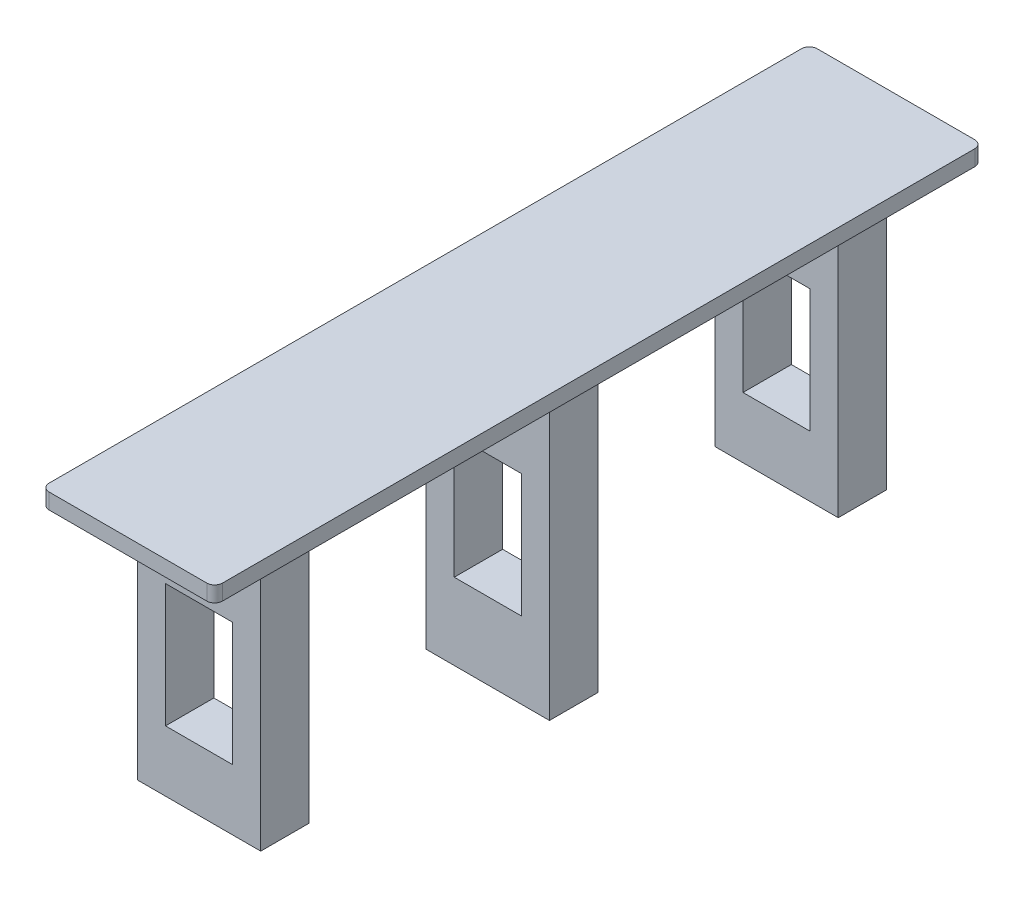
ISO-10303-21;
HEADER;
FILE_DESCRIPTION(('STEP AP214'),'2;1');
FILE_NAME('part.step','',(''),(''),'','','');
FILE_SCHEMA(('AUTOMOTIVE_DESIGN { 1 0 10303 214 1 1 1 1 }'));
ENDSEC;
DATA;
#1=APPLICATION_CONTEXT('core data for automotive mechanical design processes');
#2=APPLICATION_PROTOCOL_DEFINITION('international standard','automotive_design',2000,#1);
#3=PRODUCT_CONTEXT('',#1,'mechanical');
#4=PRODUCT('Part','Part','',(#3));
#5=PRODUCT_RELATED_PRODUCT_CATEGORY('part','',(#4));
#6=PRODUCT_DEFINITION_FORMATION('','',#4);
#7=PRODUCT_DEFINITION_CONTEXT('part definition',#1,'design');
#8=PRODUCT_DEFINITION('design','',#6,#7);
#9=PRODUCT_DEFINITION_SHAPE('','',#8);
#10=(LENGTH_UNIT() NAMED_UNIT(*) SI_UNIT(.MILLI.,.METRE.));
#11=(NAMED_UNIT(*) PLANE_ANGLE_UNIT() SI_UNIT($,.RADIAN.));
#12=(NAMED_UNIT(*) SI_UNIT($,.STERADIAN.) SOLID_ANGLE_UNIT());
#13=UNCERTAINTY_MEASURE_WITH_UNIT(LENGTH_MEASURE(1.E-05),#10,'distance_accuracy_value','');
#14=(GEOMETRIC_REPRESENTATION_CONTEXT(3) GLOBAL_UNCERTAINTY_ASSIGNED_CONTEXT((#13)) GLOBAL_UNIT_ASSIGNED_CONTEXT((#10,
#11,#12)) REPRESENTATION_CONTEXT('',''));
#15=CARTESIAN_POINT('',(0.,0.,0.));
#16=DIRECTION('',(0.,0.,1.));
#17=DIRECTION('',(1.,0.,0.));
#18=AXIS2_PLACEMENT_3D('',#15,#16,#17);
#19=CARTESIAN_POINT('',(-1.4097,0.254,-6.1214));
#20=DIRECTION('',(1.,0.,0.));
#21=DIRECTION('',(0.,0.,-1.));
#22=AXIS2_PLACEMENT_3D('',#19,#20,#21);
#23=PLANE('',#22);
#24=DIRECTION('',(0.,0.,1.));
#25=VECTOR('',#24,1.);
#26=CARTESIAN_POINT('',(-1.4097,0.,-6.1214));
#27=LINE('',#26,#25);
#28=CARTESIAN_POINT('',(-1.4097,0.,-6.1214));
#29=VERTEX_POINT('',#28);
#30=CARTESIAN_POINT('',(-1.4097,0.,6.1214));
#31=VERTEX_POINT('',#30);
#32=EDGE_CURVE('E10',#29,#31,#27,.T.);
#33=ORIENTED_EDGE('',*,*,#32,.T.);
#34=DIRECTION('',(0.,-1.,0.));
#35=VECTOR('',#34,1.);
#36=CARTESIAN_POINT('',(-1.4097,0.254,6.1214));
#37=LINE('',#36,#35);
#38=CARTESIAN_POINT('',(-1.4097,0.254,6.1214));
#39=VERTEX_POINT('',#38);
#40=EDGE_CURVE('E24',#39,#31,#37,.T.);
#41=ORIENTED_EDGE('',*,*,#40,.F.);
#42=DIRECTION('',(0.,0.,1.));
#43=VECTOR('',#42,1.);
#44=CARTESIAN_POINT('',(-1.4097,0.254,-6.1214));
#45=LINE('',#44,#43);
#46=CARTESIAN_POINT('',(-1.4097,0.254,-6.1214));
#47=VERTEX_POINT('',#46);
#48=EDGE_CURVE('E647',#47,#39,#45,.T.);
#49=ORIENTED_EDGE('',*,*,#48,.F.);
#50=DIRECTION('',(0.,-1.,0.));
#51=VECTOR('',#50,1.);
#52=CARTESIAN_POINT('',(-1.4097,0.254,-6.1214));
#53=LINE('',#52,#51);
#54=EDGE_CURVE('E643',#47,#29,#53,.T.);
#55=ORIENTED_EDGE('',*,*,#54,.T.);
#56=EDGE_LOOP('',(#33,#41,#49,#55));
#57=FACE_BOUND('',#56,.T.);
#58=ADVANCED_FACE('F16',(#57),#23,.F.);
#59=CARTESIAN_POINT('',(-1.28270000000003,0.254,-6.1214));
#60=DIRECTION('',(0.,-1.,0.));
#61=DIRECTION('',(0.707106781186463,0.,0.707106781186632));
#62=AXIS2_PLACEMENT_3D('',#59,#60,#61);
#63=CYLINDRICAL_SURFACE('',#62,0.126999999999972);
#64=CARTESIAN_POINT('',(-1.28270000000003,0.,-6.1214));
#65=DIRECTION('',(0.,1.,0.));
#66=DIRECTION('',(1.,0.,0.));
#67=AXIS2_PLACEMENT_3D('',#64,#65,#66);
#68=CIRCLE('',#67,0.126999999999972);
#69=CARTESIAN_POINT('',(-1.2827,0.,-6.2484));
#70=VERTEX_POINT('',#69);
#71=EDGE_CURVE('E638',#70,#29,#68,.T.);
#72=ORIENTED_EDGE('',*,*,#71,.T.);
#73=ORIENTED_EDGE('',*,*,#54,.F.);
#74=CARTESIAN_POINT('',(-1.28270000000003,0.254,-6.1214));
#75=DIRECTION('',(0.,1.,0.));
#76=DIRECTION('',(1.,0.,0.));
#77=AXIS2_PLACEMENT_3D('',#74,#75,#76);
#78=CIRCLE('',#77,0.126999999999972);
#79=CARTESIAN_POINT('',(-1.2827,0.254,-6.2484));
#80=VERTEX_POINT('',#79);
#81=EDGE_CURVE('E633',#80,#47,#78,.T.);
#82=ORIENTED_EDGE('',*,*,#81,.F.);
#83=DIRECTION('',(0.,-1.,0.));
#84=VECTOR('',#83,1.);
#85=CARTESIAN_POINT('',(-1.2827,0.254,-6.2484));
#86=LINE('',#85,#84);
#87=EDGE_CURVE('E629',#80,#70,#86,.T.);
#88=ORIENTED_EDGE('',*,*,#87,.T.);
#89=EDGE_LOOP('',(#72,#73,#82,#88));
#90=FACE_BOUND('',#89,.T.);
#91=ADVANCED_FACE('F665',(#90),#63,.T.);
#92=CARTESIAN_POINT('',(1.2827,0.254,-6.2484));
#93=DIRECTION('',(0.,0.,1.));
#94=DIRECTION('',(1.,0.,0.));
#95=AXIS2_PLACEMENT_3D('',#92,#93,#94);
#96=PLANE('',#95);
#97=DIRECTION('',(-1.,0.,0.));
#98=VECTOR('',#97,1.);
#99=CARTESIAN_POINT('',(1.2827,0.,-6.2484));
#100=LINE('',#99,#98);
#101=CARTESIAN_POINT('',(1.2827,0.,-6.2484));
#102=VERTEX_POINT('',#101);
#103=EDGE_CURVE('E624',#102,#70,#100,.T.);
#104=ORIENTED_EDGE('',*,*,#103,.T.);
#105=ORIENTED_EDGE('',*,*,#87,.F.);
#106=DIRECTION('',(-1.,0.,0.));
#107=VECTOR('',#106,1.);
#108=CARTESIAN_POINT('',(1.2827,0.254,-6.2484));
#109=LINE('',#108,#107);
#110=CARTESIAN_POINT('',(1.2827,0.254,-6.2484));
#111=VERTEX_POINT('',#110);
#112=EDGE_CURVE('E619',#111,#80,#109,.T.);
#113=ORIENTED_EDGE('',*,*,#112,.F.);
#114=DIRECTION('',(0.,-1.,0.));
#115=VECTOR('',#114,1.);
#116=CARTESIAN_POINT('',(1.2827,0.254,-6.2484));
#117=LINE('',#116,#115);
#118=EDGE_CURVE('E615',#111,#102,#117,.T.);
#119=ORIENTED_EDGE('',*,*,#118,.T.);
#120=EDGE_LOOP('',(#104,#105,#113,#119));
#121=FACE_BOUND('',#120,.T.);
#122=ADVANCED_FACE('F686',(#121),#96,.F.);
#123=CARTESIAN_POINT('',(1.28270000000003,0.254,-6.1214));
#124=DIRECTION('',(0.,-1.,0.));
#125=DIRECTION('',(-0.707106781186464,0.,0.707106781186631));
#126=AXIS2_PLACEMENT_3D('',#123,#124,#125);
#127=CYLINDRICAL_SURFACE('',#126,0.126999999999971);
#128=CARTESIAN_POINT('',(1.28270000000003,0.,-6.1214));
#129=DIRECTION('',(0.,1.,0.));
#130=DIRECTION('',(1.,0.,0.));
#131=AXIS2_PLACEMENT_3D('',#128,#129,#130);
#132=CIRCLE('',#131,0.126999999999971);
#133=CARTESIAN_POINT('',(1.4097,0.,-6.1214));
#134=VERTEX_POINT('',#133);
#135=EDGE_CURVE('E610',#134,#102,#132,.T.);
#136=ORIENTED_EDGE('',*,*,#135,.T.);
#137=ORIENTED_EDGE('',*,*,#118,.F.);
#138=CARTESIAN_POINT('',(1.28270000000003,0.254,-6.1214));
#139=DIRECTION('',(0.,1.,0.));
#140=DIRECTION('',(1.,0.,0.));
#141=AXIS2_PLACEMENT_3D('',#138,#139,#140);
#142=CIRCLE('',#141,0.126999999999971);
#143=CARTESIAN_POINT('',(1.4097,0.254,-6.1214));
#144=VERTEX_POINT('',#143);
#145=EDGE_CURVE('E605',#144,#111,#142,.T.);
#146=ORIENTED_EDGE('',*,*,#145,.F.);
#147=DIRECTION('',(0.,-1.,0.));
#148=VECTOR('',#147,1.);
#149=CARTESIAN_POINT('',(1.4097,0.254,-6.1214));
#150=LINE('',#149,#148);
#151=EDGE_CURVE('E601',#144,#134,#150,.T.);
#152=ORIENTED_EDGE('',*,*,#151,.T.);
#153=EDGE_LOOP('',(#136,#137,#146,#152));
#154=FACE_BOUND('',#153,.T.);
#155=ADVANCED_FACE('F683',(#154),#127,.T.);
#156=CARTESIAN_POINT('',(1.4097,0.254,6.1214));
#157=DIRECTION('',(-1.,0.,0.));
#158=DIRECTION('',(0.,0.,1.));
#159=AXIS2_PLACEMENT_3D('',#156,#157,#158);
#160=PLANE('',#159);
#161=DIRECTION('',(0.,0.,-1.));
#162=VECTOR('',#161,1.);
#163=CARTESIAN_POINT('',(1.4097,0.,6.1214));
#164=LINE('',#163,#162);
#165=CARTESIAN_POINT('',(1.4097,0.,6.1214));
#166=VERTEX_POINT('',#165);
#167=EDGE_CURVE('E596',#166,#134,#164,.T.);
#168=ORIENTED_EDGE('',*,*,#167,.T.);
#169=ORIENTED_EDGE('',*,*,#151,.F.);
#170=DIRECTION('',(0.,0.,-1.));
#171=VECTOR('',#170,1.);
#172=CARTESIAN_POINT('',(1.4097,0.254,6.1214));
#173=LINE('',#172,#171);
#174=CARTESIAN_POINT('',(1.4097,0.254,6.1214));
#175=VERTEX_POINT('',#174);
#176=EDGE_CURVE('E591',#175,#144,#173,.T.);
#177=ORIENTED_EDGE('',*,*,#176,.F.);
#178=DIRECTION('',(0.,-1.,0.));
#179=VECTOR('',#178,1.);
#180=CARTESIAN_POINT('',(1.4097,0.254,6.1214));
#181=LINE('',#180,#179);
#182=EDGE_CURVE('E587',#175,#166,#181,.T.);
#183=ORIENTED_EDGE('',*,*,#182,.T.);
#184=EDGE_LOOP('',(#168,#169,#177,#183));
#185=FACE_BOUND('',#184,.T.);
#186=ADVANCED_FACE('F679',(#185),#160,.F.);
#187=CARTESIAN_POINT('',(1.28270000000003,0.254,6.1214));
#188=DIRECTION('',(0.,-1.,0.));
#189=DIRECTION('',(-0.707106781186464,0.,-0.707106781186632));
#190=AXIS2_PLACEMENT_3D('',#187,#188,#189);
#191=CYLINDRICAL_SURFACE('',#190,0.126999999999972);
#192=CARTESIAN_POINT('',(1.28270000000003,0.,6.1214));
#193=DIRECTION('',(0.,1.,0.));
#194=DIRECTION('',(1.,0.,0.));
#195=AXIS2_PLACEMENT_3D('',#192,#193,#194);
#196=CIRCLE('',#195,0.126999999999972);
#197=CARTESIAN_POINT('',(1.2827,0.,6.2484));
#198=VERTEX_POINT('',#197);
#199=EDGE_CURVE('E582',#198,#166,#196,.T.);
#200=ORIENTED_EDGE('',*,*,#199,.T.);
#201=ORIENTED_EDGE('',*,*,#182,.F.);
#202=CARTESIAN_POINT('',(1.28270000000003,0.254,6.1214));
#203=DIRECTION('',(0.,1.,0.));
#204=DIRECTION('',(1.,0.,0.));
#205=AXIS2_PLACEMENT_3D('',#202,#203,#204);
#206=CIRCLE('',#205,0.126999999999972);
#207=CARTESIAN_POINT('',(1.2827,0.254,6.2484));
#208=VERTEX_POINT('',#207);
#209=EDGE_CURVE('E577',#208,#175,#206,.T.);
#210=ORIENTED_EDGE('',*,*,#209,.F.);
#211=DIRECTION('',(0.,-1.,0.));
#212=VECTOR('',#211,1.);
#213=CARTESIAN_POINT('',(1.2827,0.254,6.2484));
#214=LINE('',#213,#212);
#215=EDGE_CURVE('E573',#208,#198,#214,.T.);
#216=ORIENTED_EDGE('',*,*,#215,.T.);
#217=EDGE_LOOP('',(#200,#201,#210,#216));
#218=FACE_BOUND('',#217,.T.);
#219=ADVANCED_FACE('F677',(#218),#191,.T.);
#220=CARTESIAN_POINT('',(-1.2827,0.254,6.2484));
#221=DIRECTION('',(0.,0.,-1.));
#222=DIRECTION('',(-1.,0.,0.));
#223=AXIS2_PLACEMENT_3D('',#220,#221,#222);
#224=PLANE('',#223);
#225=DIRECTION('',(1.,0.,0.));
#226=VECTOR('',#225,1.);
#227=CARTESIAN_POINT('',(-1.2827,0.,6.2484));
#228=LINE('',#227,#226);
#229=CARTESIAN_POINT('',(-1.2827,0.,6.2484));
#230=VERTEX_POINT('',#229);
#231=EDGE_CURVE('E568',#230,#198,#228,.T.);
#232=ORIENTED_EDGE('',*,*,#231,.T.);
#233=ORIENTED_EDGE('',*,*,#215,.F.);
#234=DIRECTION('',(1.,0.,0.));
#235=VECTOR('',#234,1.);
#236=CARTESIAN_POINT('',(-1.2827,0.254,6.2484));
#237=LINE('',#236,#235);
#238=CARTESIAN_POINT('',(-1.2827,0.254,6.2484));
#239=VERTEX_POINT('',#238);
#240=EDGE_CURVE('E563',#239,#208,#237,.T.);
#241=ORIENTED_EDGE('',*,*,#240,.F.);
#242=DIRECTION('',(0.,-1.,0.));
#243=VECTOR('',#242,1.);
#244=CARTESIAN_POINT('',(-1.2827,0.254,6.2484));
#245=LINE('',#244,#243);
#246=EDGE_CURVE('E559',#239,#230,#245,.T.);
#247=ORIENTED_EDGE('',*,*,#246,.T.);
#248=EDGE_LOOP('',(#232,#233,#241,#247));
#249=FACE_BOUND('',#248,.T.);
#250=ADVANCED_FACE('F674',(#249),#224,.F.);
#251=CARTESIAN_POINT('',(-1.28270000000003,0.254,6.1214));
#252=DIRECTION('',(0.,-1.,0.));
#253=DIRECTION('',(0.707106781186463,0.,-0.707106781186632));
#254=AXIS2_PLACEMENT_3D('',#251,#252,#253);
#255=CYLINDRICAL_SURFACE('',#254,0.126999999999971);
#256=CARTESIAN_POINT('',(-1.28270000000003,0.,6.1214));
#257=DIRECTION('',(0.,1.,0.));
#258=DIRECTION('',(1.,0.,0.));
#259=AXIS2_PLACEMENT_3D('',#256,#257,#258);
#260=CIRCLE('',#259,0.126999999999971);
#261=EDGE_CURVE('E554',#31,#230,#260,.T.);
#262=ORIENTED_EDGE('',*,*,#261,.T.);
#263=ORIENTED_EDGE('',*,*,#246,.F.);
#264=CARTESIAN_POINT('',(-1.28270000000003,0.254,6.1214));
#265=DIRECTION('',(0.,1.,0.));
#266=DIRECTION('',(1.,0.,0.));
#267=AXIS2_PLACEMENT_3D('',#264,#265,#266);
#268=CIRCLE('',#267,0.126999999999971);
#269=EDGE_CURVE('E549',#39,#239,#268,.T.);
#270=ORIENTED_EDGE('',*,*,#269,.F.);
#271=ORIENTED_EDGE('',*,*,#40,.T.);
#272=EDGE_LOOP('',(#262,#263,#270,#271));
#273=FACE_BOUND('',#272,.T.);
#274=ADVANCED_FACE('F657',(#273),#255,.T.);
#275=CARTESIAN_POINT('',(-1.28270000000003,0.254,6.1214));
#276=DIRECTION('',(0.,1.,0.));
#277=DIRECTION('',(0.,0.,1.));
#278=AXIS2_PLACEMENT_3D('',#275,#276,#277);
#279=PLANE('',#278);
#280=ORIENTED_EDGE('',*,*,#48,.T.);
#281=ORIENTED_EDGE('',*,*,#269,.T.);
#282=ORIENTED_EDGE('',*,*,#240,.T.);
#283=ORIENTED_EDGE('',*,*,#209,.T.);
#284=ORIENTED_EDGE('',*,*,#176,.T.);
#285=ORIENTED_EDGE('',*,*,#145,.T.);
#286=ORIENTED_EDGE('',*,*,#112,.T.);
#287=ORIENTED_EDGE('',*,*,#81,.T.);
#288=EDGE_LOOP('',(#280,#281,#282,#283,#284,#285,#286,#287));
#289=FACE_BOUND('',#288,.T.);
#290=ADVANCED_FACE('F661',(#289),#279,.T.);
#291=CARTESIAN_POINT('',(-1.28270000000003,0.,6.1214));
#292=DIRECTION('',(0.,1.,0.));
#293=DIRECTION('',(0.,0.,1.));
#294=AXIS2_PLACEMENT_3D('',#291,#292,#293);
#295=PLANE('',#294);
#296=DIRECTION('',(0.,0.,-1.));
#297=VECTOR('',#296,1.);
#298=CARTESIAN_POINT('',(-1.0033,0.,0.3937));
#299=LINE('',#298,#297);
#300=CARTESIAN_POINT('',(-1.0033,0.,0.3937));
#301=VERTEX_POINT('',#300);
#302=CARTESIAN_POINT('',(-1.0033,0.,-0.3937));
#303=VERTEX_POINT('',#302);
#304=EDGE_CURVE('E544',#301,#303,#299,.T.);
#305=ORIENTED_EDGE('',*,*,#304,.F.);
#306=DIRECTION('',(-1.,0.,0.));
#307=VECTOR('',#306,1.);
#308=CARTESIAN_POINT('',(1.0033,0.,0.3937));
#309=LINE('',#308,#307);
#310=CARTESIAN_POINT('',(1.0033,0.,0.3937));
#311=VERTEX_POINT('',#310);
#312=EDGE_CURVE('E539',#311,#301,#309,.T.);
#313=ORIENTED_EDGE('',*,*,#312,.F.);
#314=DIRECTION('',(0.,0.,-1.));
#315=VECTOR('',#314,1.);
#316=CARTESIAN_POINT('',(1.0033,0.,0.3937));
#317=LINE('',#316,#315);
#318=CARTESIAN_POINT('',(1.0033,0.,-0.3937));
#319=VERTEX_POINT('',#318);
#320=EDGE_CURVE('E535',#311,#319,#317,.T.);
#321=ORIENTED_EDGE('',*,*,#320,.T.);
#322=DIRECTION('',(-1.,0.,0.));
#323=VECTOR('',#322,1.);
#324=CARTESIAN_POINT('',(1.0033,0.,-0.3937));
#325=LINE('',#324,#323);
#326=EDGE_CURVE('E531',#319,#303,#325,.T.);
#327=ORIENTED_EDGE('',*,*,#326,.T.);
#328=EDGE_LOOP('',(#305,#313,#321,#327));
#329=FACE_BOUND('',#328,.T.);
#330=DIRECTION('',(0.,0.,-1.));
#331=VECTOR('',#330,1.);
#332=CARTESIAN_POINT('',(-1.0033,0.,5.0927));
#333=LINE('',#332,#331);
#334=CARTESIAN_POINT('',(-1.0033,0.,5.0927));
#335=VERTEX_POINT('',#334);
#336=CARTESIAN_POINT('',(-1.0033,0.,4.3053));
#337=VERTEX_POINT('',#336);
#338=EDGE_CURVE('E526',#335,#337,#333,.T.);
#339=ORIENTED_EDGE('',*,*,#338,.F.);
#340=DIRECTION('',(-1.,0.,0.));
#341=VECTOR('',#340,1.);
#342=CARTESIAN_POINT('',(1.0033,0.,5.0927));
#343=LINE('',#342,#341);
#344=CARTESIAN_POINT('',(1.0033,0.,5.0927));
#345=VERTEX_POINT('',#344);
#346=EDGE_CURVE('E521',#345,#335,#343,.T.);
#347=ORIENTED_EDGE('',*,*,#346,.F.);
#348=DIRECTION('',(0.,0.,-1.));
#349=VECTOR('',#348,1.);
#350=CARTESIAN_POINT('',(1.0033,0.,5.0927));
#351=LINE('',#350,#349);
#352=CARTESIAN_POINT('',(1.0033,0.,4.3053));
#353=VERTEX_POINT('',#352);
#354=EDGE_CURVE('E517',#345,#353,#351,.T.);
#355=ORIENTED_EDGE('',*,*,#354,.T.);
#356=DIRECTION('',(-1.,0.,0.));
#357=VECTOR('',#356,1.);
#358=CARTESIAN_POINT('',(1.0033,0.,4.3053));
#359=LINE('',#358,#357);
#360=EDGE_CURVE('E513',#353,#337,#359,.T.);
#361=ORIENTED_EDGE('',*,*,#360,.T.);
#362=EDGE_LOOP('',(#339,#347,#355,#361));
#363=FACE_BOUND('',#362,.T.);
#364=DIRECTION('',(0.,0.,-1.));
#365=VECTOR('',#364,1.);
#366=CARTESIAN_POINT('',(-1.0033,0.,-4.3053));
#367=LINE('',#366,#365);
#368=CARTESIAN_POINT('',(-1.0033,0.,-4.3053));
#369=VERTEX_POINT('',#368);
#370=CARTESIAN_POINT('',(-1.0033,0.,-5.0927));
#371=VERTEX_POINT('',#370);
#372=EDGE_CURVE('E508',#369,#371,#367,.T.);
#373=ORIENTED_EDGE('',*,*,#372,.F.);
#374=DIRECTION('',(-1.,0.,0.));
#375=VECTOR('',#374,1.);
#376=CARTESIAN_POINT('',(1.0033,0.,-4.3053));
#377=LINE('',#376,#375);
#378=CARTESIAN_POINT('',(1.0033,0.,-4.3053));
#379=VERTEX_POINT('',#378);
#380=EDGE_CURVE('E503',#379,#369,#377,.T.);
#381=ORIENTED_EDGE('',*,*,#380,.F.);
#382=DIRECTION('',(0.,0.,-1.));
#383=VECTOR('',#382,1.);
#384=CARTESIAN_POINT('',(1.0033,0.,-4.3053));
#385=LINE('',#384,#383);
#386=CARTESIAN_POINT('',(1.0033,0.,-5.0927));
#387=VERTEX_POINT('',#386);
#388=EDGE_CURVE('E499',#379,#387,#385,.T.);
#389=ORIENTED_EDGE('',*,*,#388,.T.);
#390=DIRECTION('',(-1.,0.,0.));
#391=VECTOR('',#390,1.);
#392=CARTESIAN_POINT('',(1.0033,0.,-5.0927));
#393=LINE('',#392,#391);
#394=EDGE_CURVE('E495',#387,#371,#393,.T.);
#395=ORIENTED_EDGE('',*,*,#394,.T.);
#396=EDGE_LOOP('',(#373,#381,#389,#395));
#397=FACE_BOUND('',#396,.T.);
#398=ORIENTED_EDGE('',*,*,#32,.F.);
#399=ORIENTED_EDGE('',*,*,#71,.F.);
#400=ORIENTED_EDGE('',*,*,#103,.F.);
#401=ORIENTED_EDGE('',*,*,#135,.F.);
#402=ORIENTED_EDGE('',*,*,#167,.F.);
#403=ORIENTED_EDGE('',*,*,#199,.F.);
#404=ORIENTED_EDGE('',*,*,#231,.F.);
#405=ORIENTED_EDGE('',*,*,#261,.F.);
#406=EDGE_LOOP('',(#398,#399,#400,#401,#402,#403,#404,#405));
#407=FACE_BOUND('',#406,.T.);
#408=ADVANCED_FACE('F669',(#329,#363,#397,#407),#295,.F.);
#409=CARTESIAN_POINT('',(0.,0.,-5.0927));
#410=DIRECTION('',(0.,0.,1.));
#411=DIRECTION('',(1.,0.,0.));
#412=AXIS2_PLACEMENT_3D('',#409,#410,#411);
#413=PLANE('',#412);
#414=DIRECTION('',(0.,-1.,0.));
#415=VECTOR('',#414,1.);
#416=CARTESIAN_POINT('',(-0.5461,-1.2446,-5.0927));
#417=LINE('',#416,#415);
#418=CARTESIAN_POINT('',(-0.5461,-1.2446,-5.0927));
#419=VERTEX_POINT('',#418);
#420=CARTESIAN_POINT('',(-0.5461,-3.2512,-5.0927));
#421=VERTEX_POINT('',#420);
#422=EDGE_CURVE('E491',#419,#421,#417,.T.);
#423=ORIENTED_EDGE('',*,*,#422,.T.);
#424=DIRECTION('',(1.,0.,0.));
#425=VECTOR('',#424,1.);
#426=CARTESIAN_POINT('',(-0.5461,-3.2512,-5.0927));
#427=LINE('',#426,#425);
#428=CARTESIAN_POINT('',(0.5461,-3.2512,-5.0927));
#429=VERTEX_POINT('',#428);
#430=EDGE_CURVE('E487',#421,#429,#427,.T.);
#431=ORIENTED_EDGE('',*,*,#430,.T.);
#432=DIRECTION('',(0.,1.,0.));
#433=VECTOR('',#432,1.);
#434=CARTESIAN_POINT('',(0.5461,-3.2512,-5.0927));
#435=LINE('',#434,#433);
#436=CARTESIAN_POINT('',(0.5461,-1.2446,-5.0927));
#437=VERTEX_POINT('',#436);
#438=EDGE_CURVE('E483',#429,#437,#435,.T.);
#439=ORIENTED_EDGE('',*,*,#438,.T.);
#440=DIRECTION('',(-1.,0.,0.));
#441=VECTOR('',#440,1.);
#442=CARTESIAN_POINT('',(0.5461,-1.2446,-5.0927));
#443=LINE('',#442,#441);
#444=EDGE_CURVE('E479',#437,#419,#443,.T.);
#445=ORIENTED_EDGE('',*,*,#444,.T.);
#446=EDGE_LOOP('',(#423,#431,#439,#445));
#447=FACE_BOUND('',#446,.T.);
#448=DIRECTION('',(0.,-1.,0.));
#449=VECTOR('',#448,1.);
#450=CARTESIAN_POINT('',(-1.0033,0.,-5.0927));
#451=LINE('',#450,#449);
#452=CARTESIAN_POINT('',(-1.0033,-4.2418,-5.0927));
#453=VERTEX_POINT('',#452);
#454=EDGE_CURVE('E474',#371,#453,#451,.T.);
#455=ORIENTED_EDGE('',*,*,#454,.F.);
#456=ORIENTED_EDGE('',*,*,#394,.F.);
#457=DIRECTION('',(0.,1.,0.));
#458=VECTOR('',#457,1.);
#459=CARTESIAN_POINT('',(1.0033,-4.2418,-5.0927));
#460=LINE('',#459,#458);
#461=CARTESIAN_POINT('',(1.0033,-4.2418,-5.0927));
#462=VERTEX_POINT('',#461);
#463=EDGE_CURVE('E469',#462,#387,#460,.T.);
#464=ORIENTED_EDGE('',*,*,#463,.F.);
#465=DIRECTION('',(1.,0.,0.));
#466=VECTOR('',#465,1.);
#467=CARTESIAN_POINT('',(-1.0033,-4.2418,-5.0927));
#468=LINE('',#467,#466);
#469=EDGE_CURVE('E464',#453,#462,#468,.T.);
#470=ORIENTED_EDGE('',*,*,#469,.F.);
#471=EDGE_LOOP('',(#455,#456,#464,#470));
#472=FACE_BOUND('',#471,.T.);
#473=ADVANCED_FACE('F774',(#447,#472),#413,.F.);
#474=CARTESIAN_POINT('',(-1.0033,-4.2418,-4.3053));
#475=DIRECTION('',(0.,1.,0.));
#476=DIRECTION('',(0.,0.,1.));
#477=AXIS2_PLACEMENT_3D('',#474,#475,#476);
#478=PLANE('',#477);
#479=ORIENTED_EDGE('',*,*,#469,.T.);
#480=DIRECTION('',(0.,0.,-1.));
#481=VECTOR('',#480,1.);
#482=CARTESIAN_POINT('',(1.0033,-4.2418,-4.3053));
#483=LINE('',#482,#481);
#484=CARTESIAN_POINT('',(1.0033,-4.2418,-4.3053));
#485=VERTEX_POINT('',#484);
#486=EDGE_CURVE('E459',#485,#462,#483,.T.);
#487=ORIENTED_EDGE('',*,*,#486,.F.);
#488=DIRECTION('',(1.,0.,0.));
#489=VECTOR('',#488,1.);
#490=CARTESIAN_POINT('',(-1.0033,-4.2418,-4.3053));
#491=LINE('',#490,#489);
#492=CARTESIAN_POINT('',(-1.0033,-4.2418,-4.3053));
#493=VERTEX_POINT('',#492);
#494=EDGE_CURVE('E454',#493,#485,#491,.T.);
#495=ORIENTED_EDGE('',*,*,#494,.F.);
#496=DIRECTION('',(0.,0.,-1.));
#497=VECTOR('',#496,1.);
#498=CARTESIAN_POINT('',(-1.0033,-4.2418,-4.3053));
#499=LINE('',#498,#497);
#500=EDGE_CURVE('E449',#493,#453,#499,.T.);
#501=ORIENTED_EDGE('',*,*,#500,.T.);
#502=EDGE_LOOP('',(#479,#487,#495,#501));
#503=FACE_BOUND('',#502,.T.);
#504=ADVANCED_FACE('F785',(#503),#478,.F.);
#505=CARTESIAN_POINT('',(-1.0033,0.,-4.3053));
#506=DIRECTION('',(1.,0.,0.));
#507=DIRECTION('',(0.,0.,-1.));
#508=AXIS2_PLACEMENT_3D('',#505,#506,#507);
#509=PLANE('',#508);
#510=ORIENTED_EDGE('',*,*,#454,.T.);
#511=ORIENTED_EDGE('',*,*,#500,.F.);
#512=DIRECTION('',(0.,-1.,0.));
#513=VECTOR('',#512,1.);
#514=CARTESIAN_POINT('',(-1.0033,0.,-4.3053));
#515=LINE('',#514,#513);
#516=EDGE_CURVE('E444',#369,#493,#515,.T.);
#517=ORIENTED_EDGE('',*,*,#516,.F.);
#518=ORIENTED_EDGE('',*,*,#372,.T.);
#519=EDGE_LOOP('',(#510,#511,#517,#518));
#520=FACE_BOUND('',#519,.T.);
#521=ADVANCED_FACE('F796',(#520),#509,.F.);
#522=CARTESIAN_POINT('',(0.,0.,-4.3053));
#523=DIRECTION('',(0.,0.,1.));
#524=DIRECTION('',(1.,0.,0.));
#525=AXIS2_PLACEMENT_3D('',#522,#523,#524);
#526=PLANE('',#525);
#527=DIRECTION('',(0.,-1.,0.));
#528=VECTOR('',#527,1.);
#529=CARTESIAN_POINT('',(-0.5461,-1.2446,-4.3053));
#530=LINE('',#529,#528);
#531=CARTESIAN_POINT('',(-0.5461,-1.2446,-4.3053));
#532=VERTEX_POINT('',#531);
#533=CARTESIAN_POINT('',(-0.5461,-3.2512,-4.3053));
#534=VERTEX_POINT('',#533);
#535=EDGE_CURVE('E439',#532,#534,#530,.T.);
#536=ORIENTED_EDGE('',*,*,#535,.F.);
#537=DIRECTION('',(-1.,0.,0.));
#538=VECTOR('',#537,1.);
#539=CARTESIAN_POINT('',(0.5461,-1.2446,-4.3053));
#540=LINE('',#539,#538);
#541=CARTESIAN_POINT('',(0.5461,-1.2446,-4.3053));
#542=VERTEX_POINT('',#541);
#543=EDGE_CURVE('E434',#542,#532,#540,.T.);
#544=ORIENTED_EDGE('',*,*,#543,.F.);
#545=DIRECTION('',(0.,1.,0.));
#546=VECTOR('',#545,1.);
#547=CARTESIAN_POINT('',(0.5461,-3.2512,-4.3053));
#548=LINE('',#547,#546);
#549=CARTESIAN_POINT('',(0.5461,-3.2512,-4.3053));
#550=VERTEX_POINT('',#549);
#551=EDGE_CURVE('E429',#550,#542,#548,.T.);
#552=ORIENTED_EDGE('',*,*,#551,.F.);
#553=DIRECTION('',(1.,0.,0.));
#554=VECTOR('',#553,1.);
#555=CARTESIAN_POINT('',(-0.5461,-3.2512,-4.3053));
#556=LINE('',#555,#554);
#557=EDGE_CURVE('E424',#534,#550,#556,.T.);
#558=ORIENTED_EDGE('',*,*,#557,.F.);
#559=EDGE_LOOP('',(#536,#544,#552,#558));
#560=FACE_BOUND('',#559,.T.);
#561=ORIENTED_EDGE('',*,*,#516,.T.);
#562=ORIENTED_EDGE('',*,*,#494,.T.);
#563=DIRECTION('',(0.,1.,0.));
#564=VECTOR('',#563,1.);
#565=CARTESIAN_POINT('',(1.0033,-4.2418,-4.3053));
#566=LINE('',#565,#564);
#567=EDGE_CURVE('E419',#485,#379,#566,.T.);
#568=ORIENTED_EDGE('',*,*,#567,.T.);
#569=ORIENTED_EDGE('',*,*,#380,.T.);
#570=EDGE_LOOP('',(#561,#562,#568,#569));
#571=FACE_BOUND('',#570,.T.);
#572=ADVANCED_FACE('F807',(#560,#571),#526,.T.);
#573=CARTESIAN_POINT('',(1.0033,-4.2418,-4.3053));
#574=DIRECTION('',(-1.,0.,0.));
#575=DIRECTION('',(0.,0.,1.));
#576=AXIS2_PLACEMENT_3D('',#573,#574,#575);
#577=PLANE('',#576);
#578=ORIENTED_EDGE('',*,*,#463,.T.);
#579=ORIENTED_EDGE('',*,*,#388,.F.);
#580=ORIENTED_EDGE('',*,*,#567,.F.);
#581=ORIENTED_EDGE('',*,*,#486,.T.);
#582=EDGE_LOOP('',(#578,#579,#580,#581));
#583=FACE_BOUND('',#582,.T.);
#584=ADVANCED_FACE('F818',(#583),#577,.F.);
#585=CARTESIAN_POINT('',(-0.5461,-3.2512,-4.3053));
#586=DIRECTION('',(0.,1.,0.));
#587=DIRECTION('',(0.,0.,1.));
#588=AXIS2_PLACEMENT_3D('',#585,#586,#587);
#589=PLANE('',#588);
#590=ORIENTED_EDGE('',*,*,#430,.F.);
#591=DIRECTION('',(0.,0.,-1.));
#592=VECTOR('',#591,1.);
#593=CARTESIAN_POINT('',(-0.5461,-3.2512,-4.3053));
#594=LINE('',#593,#592);
#595=EDGE_CURVE('E414',#534,#421,#594,.T.);
#596=ORIENTED_EDGE('',*,*,#595,.F.);
#597=ORIENTED_EDGE('',*,*,#557,.T.);
#598=DIRECTION('',(0.,0.,-1.));
#599=VECTOR('',#598,1.);
#600=CARTESIAN_POINT('',(0.5461,-3.2512,-4.3053));
#601=LINE('',#600,#599);
#602=EDGE_CURVE('E409',#550,#429,#601,.T.);
#603=ORIENTED_EDGE('',*,*,#602,.T.);
#604=EDGE_LOOP('',(#590,#596,#597,#603));
#605=FACE_BOUND('',#604,.T.);
#606=ADVANCED_FACE('F829',(#605),#589,.T.);
#607=CARTESIAN_POINT('',(0.5461,-3.2512,-4.3053));
#608=DIRECTION('',(-1.,0.,0.));
#609=DIRECTION('',(0.,0.,1.));
#610=AXIS2_PLACEMENT_3D('',#607,#608,#609);
#611=PLANE('',#610);
#612=ORIENTED_EDGE('',*,*,#438,.F.);
#613=ORIENTED_EDGE('',*,*,#602,.F.);
#614=ORIENTED_EDGE('',*,*,#551,.T.);
#615=DIRECTION('',(0.,0.,-1.));
#616=VECTOR('',#615,1.);
#617=CARTESIAN_POINT('',(0.5461,-1.2446,-4.3053));
#618=LINE('',#617,#616);
#619=EDGE_CURVE('E404',#542,#437,#618,.T.);
#620=ORIENTED_EDGE('',*,*,#619,.T.);
#621=EDGE_LOOP('',(#612,#613,#614,#620));
#622=FACE_BOUND('',#621,.T.);
#623=ADVANCED_FACE('F840',(#622),#611,.T.);
#624=CARTESIAN_POINT('',(0.5461,-1.2446,-4.3053));
#625=DIRECTION('',(0.,-1.,0.));
#626=DIRECTION('',(0.,0.,-1.));
#627=AXIS2_PLACEMENT_3D('',#624,#625,#626);
#628=PLANE('',#627);
#629=ORIENTED_EDGE('',*,*,#444,.F.);
#630=ORIENTED_EDGE('',*,*,#619,.F.);
#631=ORIENTED_EDGE('',*,*,#543,.T.);
#632=DIRECTION('',(0.,0.,-1.));
#633=VECTOR('',#632,1.);
#634=CARTESIAN_POINT('',(-0.5461,-1.2446,-4.3053));
#635=LINE('',#634,#633);
#636=EDGE_CURVE('E399',#532,#419,#635,.T.);
#637=ORIENTED_EDGE('',*,*,#636,.T.);
#638=EDGE_LOOP('',(#629,#630,#631,#637));
#639=FACE_BOUND('',#638,.T.);
#640=ADVANCED_FACE('F851',(#639),#628,.T.);
#641=CARTESIAN_POINT('',(-0.5461,-1.2446,-4.3053));
#642=DIRECTION('',(1.,0.,0.));
#643=DIRECTION('',(0.,0.,-1.));
#644=AXIS2_PLACEMENT_3D('',#641,#642,#643);
#645=PLANE('',#644);
#646=ORIENTED_EDGE('',*,*,#422,.F.);
#647=ORIENTED_EDGE('',*,*,#636,.F.);
#648=ORIENTED_EDGE('',*,*,#535,.T.);
#649=ORIENTED_EDGE('',*,*,#595,.T.);
#650=EDGE_LOOP('',(#646,#647,#648,#649));
#651=FACE_BOUND('',#650,.T.);
#652=ADVANCED_FACE('F862',(#651),#645,.T.);
#653=CARTESIAN_POINT('',(0.,0.,4.3053));
#654=DIRECTION('',(0.,0.,1.));
#655=DIRECTION('',(1.,0.,0.));
#656=AXIS2_PLACEMENT_3D('',#653,#654,#655);
#657=PLANE('',#656);
#658=DIRECTION('',(0.,-1.,0.));
#659=VECTOR('',#658,1.);
#660=CARTESIAN_POINT('',(-0.5461,-1.2446,4.3053));
#661=LINE('',#660,#659);
#662=CARTESIAN_POINT('',(-0.5461,-1.2446,4.3053));
#663=VERTEX_POINT('',#662);
#664=CARTESIAN_POINT('',(-0.5461,-3.2512,4.3053));
#665=VERTEX_POINT('',#664);
#666=EDGE_CURVE('E395',#663,#665,#661,.T.);
#667=ORIENTED_EDGE('',*,*,#666,.T.);
#668=DIRECTION('',(1.,0.,0.));
#669=VECTOR('',#668,1.);
#670=CARTESIAN_POINT('',(-0.5461,-3.2512,4.3053));
#671=LINE('',#670,#669);
#672=CARTESIAN_POINT('',(0.5461,-3.2512,4.3053));
#673=VERTEX_POINT('',#672);
#674=EDGE_CURVE('E391',#665,#673,#671,.T.);
#675=ORIENTED_EDGE('',*,*,#674,.T.);
#676=DIRECTION('',(0.,1.,0.));
#677=VECTOR('',#676,1.);
#678=CARTESIAN_POINT('',(0.5461,-3.2512,4.3053));
#679=LINE('',#678,#677);
#680=CARTESIAN_POINT('',(0.5461,-1.2446,4.3053));
#681=VERTEX_POINT('',#680);
#682=EDGE_CURVE('E387',#673,#681,#679,.T.);
#683=ORIENTED_EDGE('',*,*,#682,.T.);
#684=DIRECTION('',(-1.,0.,0.));
#685=VECTOR('',#684,1.);
#686=CARTESIAN_POINT('',(0.5461,-1.2446,4.3053));
#687=LINE('',#686,#685);
#688=EDGE_CURVE('E383',#681,#663,#687,.T.);
#689=ORIENTED_EDGE('',*,*,#688,.T.);
#690=EDGE_LOOP('',(#667,#675,#683,#689));
#691=FACE_BOUND('',#690,.T.);
#692=DIRECTION('',(0.,-1.,0.));
#693=VECTOR('',#692,1.);
#694=CARTESIAN_POINT('',(-1.0033,0.,4.3053));
#695=LINE('',#694,#693);
#696=CARTESIAN_POINT('',(-1.0033,-4.2418,4.3053));
#697=VERTEX_POINT('',#696);
#698=EDGE_CURVE('E378',#337,#697,#695,.T.);
#699=ORIENTED_EDGE('',*,*,#698,.F.);
#700=ORIENTED_EDGE('',*,*,#360,.F.);
#701=DIRECTION('',(0.,1.,0.));
#702=VECTOR('',#701,1.);
#703=CARTESIAN_POINT('',(1.0033,-4.2418,4.3053));
#704=LINE('',#703,#702);
#705=CARTESIAN_POINT('',(1.0033,-4.2418,4.3053));
#706=VERTEX_POINT('',#705);
#707=EDGE_CURVE('E373',#706,#353,#704,.T.);
#708=ORIENTED_EDGE('',*,*,#707,.F.);
#709=DIRECTION('',(1.,0.,0.));
#710=VECTOR('',#709,1.);
#711=CARTESIAN_POINT('',(-1.0033,-4.2418,4.3053));
#712=LINE('',#711,#710);
#713=EDGE_CURVE('E368',#697,#706,#712,.T.);
#714=ORIENTED_EDGE('',*,*,#713,.F.);
#715=EDGE_LOOP('',(#699,#700,#708,#714));
#716=FACE_BOUND('',#715,.T.);
#717=ADVANCED_FACE('F873',(#691,#716),#657,.F.);
#718=CARTESIAN_POINT('',(-1.0033,-4.2418,5.0927));
#719=DIRECTION('',(0.,1.,0.));
#720=DIRECTION('',(0.,0.,1.));
#721=AXIS2_PLACEMENT_3D('',#718,#719,#720);
#722=PLANE('',#721);
#723=ORIENTED_EDGE('',*,*,#713,.T.);
#724=DIRECTION('',(0.,0.,-1.));
#725=VECTOR('',#724,1.);
#726=CARTESIAN_POINT('',(1.0033,-4.2418,5.0927));
#727=LINE('',#726,#725);
#728=CARTESIAN_POINT('',(1.0033,-4.2418,5.0927));
#729=VERTEX_POINT('',#728);
#730=EDGE_CURVE('E363',#729,#706,#727,.T.);
#731=ORIENTED_EDGE('',*,*,#730,.F.);
#732=DIRECTION('',(1.,0.,0.));
#733=VECTOR('',#732,1.);
#734=CARTESIAN_POINT('',(-1.0033,-4.2418,5.0927));
#735=LINE('',#734,#733);
#736=CARTESIAN_POINT('',(-1.0033,-4.2418,5.0927));
#737=VERTEX_POINT('',#736);
#738=EDGE_CURVE('E358',#737,#729,#735,.T.);
#739=ORIENTED_EDGE('',*,*,#738,.F.);
#740=DIRECTION('',(0.,0.,-1.));
#741=VECTOR('',#740,1.);
#742=CARTESIAN_POINT('',(-1.0033,-4.2418,5.0927));
#743=LINE('',#742,#741);
#744=EDGE_CURVE('E353',#737,#697,#743,.T.);
#745=ORIENTED_EDGE('',*,*,#744,.T.);
#746=EDGE_LOOP('',(#723,#731,#739,#745));
#747=FACE_BOUND('',#746,.T.);
#748=ADVANCED_FACE('F884',(#747),#722,.F.);
#749=CARTESIAN_POINT('',(-1.0033,0.,5.0927));
#750=DIRECTION('',(1.,0.,0.));
#751=DIRECTION('',(0.,0.,-1.));
#752=AXIS2_PLACEMENT_3D('',#749,#750,#751);
#753=PLANE('',#752);
#754=ORIENTED_EDGE('',*,*,#698,.T.);
#755=ORIENTED_EDGE('',*,*,#744,.F.);
#756=DIRECTION('',(0.,-1.,0.));
#757=VECTOR('',#756,1.);
#758=CARTESIAN_POINT('',(-1.0033,0.,5.0927));
#759=LINE('',#758,#757);
#760=EDGE_CURVE('E348',#335,#737,#759,.T.);
#761=ORIENTED_EDGE('',*,*,#760,.F.);
#762=ORIENTED_EDGE('',*,*,#338,.T.);
#763=EDGE_LOOP('',(#754,#755,#761,#762));
#764=FACE_BOUND('',#763,.T.);
#765=ADVANCED_FACE('F895',(#764),#753,.F.);
#766=CARTESIAN_POINT('',(0.,0.,5.0927));
#767=DIRECTION('',(0.,0.,1.));
#768=DIRECTION('',(1.,0.,0.));
#769=AXIS2_PLACEMENT_3D('',#766,#767,#768);
#770=PLANE('',#769);
#771=DIRECTION('',(0.,-1.,0.));
#772=VECTOR('',#771,1.);
#773=CARTESIAN_POINT('',(-0.5461,-1.2446,5.0927));
#774=LINE('',#773,#772);
#775=CARTESIAN_POINT('',(-0.5461,-1.2446,5.0927));
#776=VERTEX_POINT('',#775);
#777=CARTESIAN_POINT('',(-0.5461,-3.2512,5.0927));
#778=VERTEX_POINT('',#777);
#779=EDGE_CURVE('E343',#776,#778,#774,.T.);
#780=ORIENTED_EDGE('',*,*,#779,.F.);
#781=DIRECTION('',(-1.,0.,0.));
#782=VECTOR('',#781,1.);
#783=CARTESIAN_POINT('',(0.5461,-1.2446,5.0927));
#784=LINE('',#783,#782);
#785=CARTESIAN_POINT('',(0.5461,-1.2446,5.0927));
#786=VERTEX_POINT('',#785);
#787=EDGE_CURVE('E338',#786,#776,#784,.T.);
#788=ORIENTED_EDGE('',*,*,#787,.F.);
#789=DIRECTION('',(0.,1.,0.));
#790=VECTOR('',#789,1.);
#791=CARTESIAN_POINT('',(0.5461,-3.2512,5.0927));
#792=LINE('',#791,#790);
#793=CARTESIAN_POINT('',(0.5461,-3.2512,5.0927));
#794=VERTEX_POINT('',#793);
#795=EDGE_CURVE('E333',#794,#786,#792,.T.);
#796=ORIENTED_EDGE('',*,*,#795,.F.);
#797=DIRECTION('',(1.,0.,0.));
#798=VECTOR('',#797,1.);
#799=CARTESIAN_POINT('',(-0.5461,-3.2512,5.0927));
#800=LINE('',#799,#798);
#801=EDGE_CURVE('E328',#778,#794,#800,.T.);
#802=ORIENTED_EDGE('',*,*,#801,.F.);
#803=EDGE_LOOP('',(#780,#788,#796,#802));
#804=FACE_BOUND('',#803,.T.);
#805=ORIENTED_EDGE('',*,*,#760,.T.);
#806=ORIENTED_EDGE('',*,*,#738,.T.);
#807=DIRECTION('',(0.,1.,0.));
#808=VECTOR('',#807,1.);
#809=CARTESIAN_POINT('',(1.0033,-4.2418,5.0927));
#810=LINE('',#809,#808);
#811=EDGE_CURVE('E323',#729,#345,#810,.T.);
#812=ORIENTED_EDGE('',*,*,#811,.T.);
#813=ORIENTED_EDGE('',*,*,#346,.T.);
#814=EDGE_LOOP('',(#805,#806,#812,#813));
#815=FACE_BOUND('',#814,.T.);
#816=ADVANCED_FACE('F906',(#804,#815),#770,.T.);
#817=CARTESIAN_POINT('',(1.0033,-4.2418,5.0927));
#818=DIRECTION('',(-1.,0.,0.));
#819=DIRECTION('',(0.,0.,1.));
#820=AXIS2_PLACEMENT_3D('',#817,#818,#819);
#821=PLANE('',#820);
#822=ORIENTED_EDGE('',*,*,#707,.T.);
#823=ORIENTED_EDGE('',*,*,#354,.F.);
#824=ORIENTED_EDGE('',*,*,#811,.F.);
#825=ORIENTED_EDGE('',*,*,#730,.T.);
#826=EDGE_LOOP('',(#822,#823,#824,#825));
#827=FACE_BOUND('',#826,.T.);
#828=ADVANCED_FACE('F917',(#827),#821,.F.);
#829=CARTESIAN_POINT('',(-0.5461,-3.2512,5.0927));
#830=DIRECTION('',(0.,1.,0.));
#831=DIRECTION('',(0.,0.,1.));
#832=AXIS2_PLACEMENT_3D('',#829,#830,#831);
#833=PLANE('',#832);
#834=ORIENTED_EDGE('',*,*,#674,.F.);
#835=DIRECTION('',(0.,0.,-1.));
#836=VECTOR('',#835,1.);
#837=CARTESIAN_POINT('',(-0.5461,-3.2512,5.0927));
#838=LINE('',#837,#836);
#839=EDGE_CURVE('E318',#778,#665,#838,.T.);
#840=ORIENTED_EDGE('',*,*,#839,.F.);
#841=ORIENTED_EDGE('',*,*,#801,.T.);
#842=DIRECTION('',(0.,0.,-1.));
#843=VECTOR('',#842,1.);
#844=CARTESIAN_POINT('',(0.5461,-3.2512,5.0927));
#845=LINE('',#844,#843);
#846=EDGE_CURVE('E313',#794,#673,#845,.T.);
#847=ORIENTED_EDGE('',*,*,#846,.T.);
#848=EDGE_LOOP('',(#834,#840,#841,#847));
#849=FACE_BOUND('',#848,.T.);
#850=ADVANCED_FACE('F928',(#849),#833,.T.);
#851=CARTESIAN_POINT('',(0.5461,-3.2512,5.0927));
#852=DIRECTION('',(-1.,0.,0.));
#853=DIRECTION('',(0.,0.,1.));
#854=AXIS2_PLACEMENT_3D('',#851,#852,#853);
#855=PLANE('',#854);
#856=ORIENTED_EDGE('',*,*,#682,.F.);
#857=ORIENTED_EDGE('',*,*,#846,.F.);
#858=ORIENTED_EDGE('',*,*,#795,.T.);
#859=DIRECTION('',(0.,0.,-1.));
#860=VECTOR('',#859,1.);
#861=CARTESIAN_POINT('',(0.5461,-1.2446,5.0927));
#862=LINE('',#861,#860);
#863=EDGE_CURVE('E308',#786,#681,#862,.T.);
#864=ORIENTED_EDGE('',*,*,#863,.T.);
#865=EDGE_LOOP('',(#856,#857,#858,#864));
#866=FACE_BOUND('',#865,.T.);
#867=ADVANCED_FACE('F939',(#866),#855,.T.);
#868=CARTESIAN_POINT('',(0.5461,-1.2446,5.0927));
#869=DIRECTION('',(0.,-1.,0.));
#870=DIRECTION('',(0.,0.,-1.));
#871=AXIS2_PLACEMENT_3D('',#868,#869,#870);
#872=PLANE('',#871);
#873=ORIENTED_EDGE('',*,*,#688,.F.);
#874=ORIENTED_EDGE('',*,*,#863,.F.);
#875=ORIENTED_EDGE('',*,*,#787,.T.);
#876=DIRECTION('',(0.,0.,-1.));
#877=VECTOR('',#876,1.);
#878=CARTESIAN_POINT('',(-0.5461,-1.2446,5.0927));
#879=LINE('',#878,#877);
#880=EDGE_CURVE('E303',#776,#663,#879,.T.);
#881=ORIENTED_EDGE('',*,*,#880,.T.);
#882=EDGE_LOOP('',(#873,#874,#875,#881));
#883=FACE_BOUND('',#882,.T.);
#884=ADVANCED_FACE('F950',(#883),#872,.T.);
#885=CARTESIAN_POINT('',(-0.5461,-1.2446,5.0927));
#886=DIRECTION('',(1.,0.,0.));
#887=DIRECTION('',(0.,0.,-1.));
#888=AXIS2_PLACEMENT_3D('',#885,#886,#887);
#889=PLANE('',#888);
#890=ORIENTED_EDGE('',*,*,#666,.F.);
#891=ORIENTED_EDGE('',*,*,#880,.F.);
#892=ORIENTED_EDGE('',*,*,#779,.T.);
#893=ORIENTED_EDGE('',*,*,#839,.T.);
#894=EDGE_LOOP('',(#890,#891,#892,#893));
#895=FACE_BOUND('',#894,.T.);
#896=ADVANCED_FACE('F961',(#895),#889,.T.);
#897=CARTESIAN_POINT('',(0.,0.,-0.3937));
#898=DIRECTION('',(0.,0.,1.));
#899=DIRECTION('',(1.,0.,0.));
#900=AXIS2_PLACEMENT_3D('',#897,#898,#899);
#901=PLANE('',#900);
#902=DIRECTION('',(0.,-1.,0.));
#903=VECTOR('',#902,1.);
#904=CARTESIAN_POINT('',(-0.5461,-1.4986,-0.3937));
#905=LINE('',#904,#903);
#906=CARTESIAN_POINT('',(-0.5461,-1.4986,-0.3937));
#907=VERTEX_POINT('',#906);
#908=CARTESIAN_POINT('',(-0.5461,-3.5052,-0.3937));
#909=VERTEX_POINT('',#908);
#910=EDGE_CURVE('E299',#907,#909,#905,.T.);
#911=ORIENTED_EDGE('',*,*,#910,.T.);
#912=DIRECTION('',(1.,0.,0.));
#913=VECTOR('',#912,1.);
#914=CARTESIAN_POINT('',(-0.5461,-3.5052,-0.3937));
#915=LINE('',#914,#913);
#916=CARTESIAN_POINT('',(0.5461,-3.5052,-0.3937));
#917=VERTEX_POINT('',#916);
#918=EDGE_CURVE('E238',#909,#917,#915,.T.);
#919=ORIENTED_EDGE('',*,*,#918,.T.);
#920=DIRECTION('',(0.,1.,0.));
#921=VECTOR('',#920,1.);
#922=CARTESIAN_POINT('',(0.5461,-3.5052,-0.3937));
#923=LINE('',#922,#921);
#924=CARTESIAN_POINT('',(0.5461,-1.4986,-0.3937));
#925=VERTEX_POINT('',#924);
#926=EDGE_CURVE('E292',#917,#925,#923,.T.);
#927=ORIENTED_EDGE('',*,*,#926,.T.);
#928=DIRECTION('',(-1.,0.,0.));
#929=VECTOR('',#928,1.);
#930=CARTESIAN_POINT('',(0.5461,-1.4986,-0.3937));
#931=LINE('',#930,#929);
#932=EDGE_CURVE('E288',#925,#907,#931,.T.);
#933=ORIENTED_EDGE('',*,*,#932,.T.);
#934=EDGE_LOOP('',(#911,#919,#927,#933));
#935=FACE_BOUND('',#934,.T.);
#936=DIRECTION('',(0.,-1.,0.));
#937=VECTOR('',#936,1.);
#938=CARTESIAN_POINT('',(-1.0033,0.,-0.3937));
#939=LINE('',#938,#937);
#940=CARTESIAN_POINT('',(-1.0033,-4.7498,-0.3937));
#941=VERTEX_POINT('',#940);
#942=EDGE_CURVE('E283',#303,#941,#939,.T.);
#943=ORIENTED_EDGE('',*,*,#942,.F.);
#944=ORIENTED_EDGE('',*,*,#326,.F.);
#945=DIRECTION('',(0.,1.,0.));
#946=VECTOR('',#945,1.);
#947=CARTESIAN_POINT('',(1.0033,-4.7498,-0.3937));
#948=LINE('',#947,#946);
#949=CARTESIAN_POINT('',(1.0033,-4.7498,-0.3937));
#950=VERTEX_POINT('',#949);
#951=EDGE_CURVE('E278',#950,#319,#948,.T.);
#952=ORIENTED_EDGE('',*,*,#951,.F.);
#953=DIRECTION('',(1.,0.,0.));
#954=VECTOR('',#953,1.);
#955=CARTESIAN_POINT('',(-1.0033,-4.7498,-0.3937));
#956=LINE('',#955,#954);
#957=EDGE_CURVE('E273',#941,#950,#956,.T.);
#958=ORIENTED_EDGE('',*,*,#957,.F.);
#959=EDGE_LOOP('',(#943,#944,#952,#958));
#960=FACE_BOUND('',#959,.T.);
#961=ADVANCED_FACE('F972',(#935,#960),#901,.F.);
#962=CARTESIAN_POINT('',(-1.0033,-4.7498,0.3937));
#963=DIRECTION('',(0.,1.,0.));
#964=DIRECTION('',(0.,0.,1.));
#965=AXIS2_PLACEMENT_3D('',#962,#963,#964);
#966=PLANE('',#965);
#967=ORIENTED_EDGE('',*,*,#957,.T.);
#968=DIRECTION('',(0.,0.,-1.));
#969=VECTOR('',#968,1.);
#970=CARTESIAN_POINT('',(1.0033,-4.7498,0.3937));
#971=LINE('',#970,#969);
#972=CARTESIAN_POINT('',(1.0033,-4.7498,0.3937));
#973=VERTEX_POINT('',#972);
#974=EDGE_CURVE('E268',#973,#950,#971,.T.);
#975=ORIENTED_EDGE('',*,*,#974,.F.);
#976=DIRECTION('',(1.,0.,0.));
#977=VECTOR('',#976,1.);
#978=CARTESIAN_POINT('',(-1.0033,-4.7498,0.3937));
#979=LINE('',#978,#977);
#980=CARTESIAN_POINT('',(-1.0033,-4.7498,0.3937));
#981=VERTEX_POINT('',#980);
#982=EDGE_CURVE('E263',#981,#973,#979,.T.);
#983=ORIENTED_EDGE('',*,*,#982,.F.);
#984=DIRECTION('',(0.,0.,-1.));
#985=VECTOR('',#984,1.);
#986=CARTESIAN_POINT('',(-1.0033,-4.7498,0.3937));
#987=LINE('',#986,#985);
#988=EDGE_CURVE('E251',#981,#941,#987,.T.);
#989=ORIENTED_EDGE('',*,*,#988,.T.);
#990=EDGE_LOOP('',(#967,#975,#983,#989));
#991=FACE_BOUND('',#990,.T.);
#992=ADVANCED_FACE('F983',(#991),#966,.F.);
#993=CARTESIAN_POINT('',(-1.0033,0.,0.3937));
#994=DIRECTION('',(1.,0.,0.));
#995=DIRECTION('',(0.,0.,-1.));
#996=AXIS2_PLACEMENT_3D('',#993,#994,#995);
#997=PLANE('',#996);
#998=ORIENTED_EDGE('',*,*,#942,.T.);
#999=ORIENTED_EDGE('',*,*,#988,.F.);
#1000=DIRECTION('',(0.,-1.,0.));
#1001=VECTOR('',#1000,1.);
#1002=CARTESIAN_POINT('',(-1.0033,0.,0.3937));
#1003=LINE('',#1002,#1001);
#1004=EDGE_CURVE('E247',#301,#981,#1003,.T.);
#1005=ORIENTED_EDGE('',*,*,#1004,.F.);
#1006=ORIENTED_EDGE('',*,*,#304,.T.);
#1007=EDGE_LOOP('',(#998,#999,#1005,#1006));
#1008=FACE_BOUND('',#1007,.T.);
#1009=ADVANCED_FACE('F994',(#1008),#997,.F.);
#1010=CARTESIAN_POINT('',(0.,0.,0.3937));
#1011=DIRECTION('',(0.,0.,1.));
#1012=DIRECTION('',(1.,0.,0.));
#1013=AXIS2_PLACEMENT_3D('',#1010,#1011,#1012);
#1014=PLANE('',#1013);
#1015=DIRECTION('',(0.,-1.,0.));
#1016=VECTOR('',#1015,1.);
#1017=CARTESIAN_POINT('',(-0.5461,-1.4986,0.3937));
#1018=LINE('',#1017,#1016);
#1019=CARTESIAN_POINT('',(-0.5461,-1.4986,0.3937));
#1020=VERTEX_POINT('',#1019);
#1021=CARTESIAN_POINT('',(-0.5461,-3.5052,0.3937));
#1022=VERTEX_POINT('',#1021);
#1023=EDGE_CURVE('E225',#1020,#1022,#1018,.T.);
#1024=ORIENTED_EDGE('',*,*,#1023,.F.);
#1025=DIRECTION('',(-1.,0.,0.));
#1026=VECTOR('',#1025,1.);
#1027=CARTESIAN_POINT('',(0.5461,-1.4986,0.3937));
#1028=LINE('',#1027,#1026);
#1029=CARTESIAN_POINT('',(0.5461,-1.4986,0.3937));
#1030=VERTEX_POINT('',#1029);
#1031=EDGE_CURVE('E248',#1030,#1020,#1028,.T.);
#1032=ORIENTED_EDGE('',*,*,#1031,.F.);
#1033=DIRECTION('',(0.,1.,0.));
#1034=VECTOR('',#1033,1.);
#1035=CARTESIAN_POINT('',(0.5461,-3.5052,0.3937));
#1036=LINE('',#1035,#1034);
#1037=CARTESIAN_POINT('',(0.5461,-3.5052,0.3937));
#1038=VERTEX_POINT('',#1037);
#1039=EDGE_CURVE('E228',#1038,#1030,#1036,.T.);
#1040=ORIENTED_EDGE('',*,*,#1039,.F.);
#1041=DIRECTION('',(1.,0.,0.));
#1042=VECTOR('',#1041,1.);
#1043=CARTESIAN_POINT('',(-0.5461,-3.5052,0.3937));
#1044=LINE('',#1043,#1042);
#1045=EDGE_CURVE('E220',#1022,#1038,#1044,.T.);
#1046=ORIENTED_EDGE('',*,*,#1045,.F.);
#1047=EDGE_LOOP('',(#1024,#1032,#1040,#1046));
#1048=FACE_BOUND('',#1047,.T.);
#1049=ORIENTED_EDGE('',*,*,#1004,.T.);
#1050=ORIENTED_EDGE('',*,*,#982,.T.);
#1051=DIRECTION('',(0.,1.,0.));
#1052=VECTOR('',#1051,1.);
#1053=CARTESIAN_POINT('',(1.0033,-4.7498,0.3937));
#1054=LINE('',#1053,#1052);
#1055=EDGE_CURVE('E232',#973,#311,#1054,.T.);
#1056=ORIENTED_EDGE('',*,*,#1055,.T.);
#1057=ORIENTED_EDGE('',*,*,#312,.T.);
#1058=EDGE_LOOP('',(#1049,#1050,#1056,#1057));
#1059=FACE_BOUND('',#1058,.T.);
#1060=ADVANCED_FACE('F222',(#1048,#1059),#1014,.T.);
#1061=CARTESIAN_POINT('',(1.0033,-4.7498,0.3937));
#1062=DIRECTION('',(-1.,0.,0.));
#1063=DIRECTION('',(0.,0.,1.));
#1064=AXIS2_PLACEMENT_3D('',#1061,#1062,#1063);
#1065=PLANE('',#1064);
#1066=ORIENTED_EDGE('',*,*,#951,.T.);
#1067=ORIENTED_EDGE('',*,*,#320,.F.);
#1068=ORIENTED_EDGE('',*,*,#1055,.F.);
#1069=ORIENTED_EDGE('',*,*,#974,.T.);
#1070=EDGE_LOOP('',(#1066,#1067,#1068,#1069));
#1071=FACE_BOUND('',#1070,.T.);
#1072=ADVANCED_FACE('F1015',(#1071),#1065,.F.);
#1073=CARTESIAN_POINT('',(-0.5461,-3.5052,0.3937));
#1074=DIRECTION('',(0.,1.,0.));
#1075=DIRECTION('',(0.,0.,1.));
#1076=AXIS2_PLACEMENT_3D('',#1073,#1074,#1075);
#1077=PLANE('',#1076);
#1078=ORIENTED_EDGE('',*,*,#918,.F.);
#1079=DIRECTION('',(0.,0.,-1.));
#1080=VECTOR('',#1079,1.);
#1081=CARTESIAN_POINT('',(-0.5461,-3.5052,0.3937));
#1082=LINE('',#1081,#1080);
#1083=EDGE_CURVE('E236',#1022,#909,#1082,.T.);
#1084=ORIENTED_EDGE('',*,*,#1083,.F.);
#1085=ORIENTED_EDGE('',*,*,#1045,.T.);
#1086=DIRECTION('',(0.,0.,-1.));
#1087=VECTOR('',#1086,1.);
#1088=CARTESIAN_POINT('',(0.5461,-3.5052,0.3937));
#1089=LINE('',#1088,#1087);
#1090=EDGE_CURVE('E241',#1038,#917,#1089,.T.);
#1091=ORIENTED_EDGE('',*,*,#1090,.T.);
#1092=EDGE_LOOP('',(#1078,#1084,#1085,#1091));
#1093=FACE_BOUND('',#1092,.T.);
#1094=ADVANCED_FACE('F237',(#1093),#1077,.T.);
#1095=CARTESIAN_POINT('',(0.5461,-3.5052,0.3937));
#1096=DIRECTION('',(-1.,0.,0.));
#1097=DIRECTION('',(0.,0.,1.));
#1098=AXIS2_PLACEMENT_3D('',#1095,#1096,#1097);
#1099=PLANE('',#1098);
#1100=ORIENTED_EDGE('',*,*,#926,.F.);
#1101=ORIENTED_EDGE('',*,*,#1090,.F.);
#1102=ORIENTED_EDGE('',*,*,#1039,.T.);
#1103=DIRECTION('',(0.,0.,-1.));
#1104=VECTOR('',#1103,1.);
#1105=CARTESIAN_POINT('',(0.5461,-1.4986,0.3937));
#1106=LINE('',#1105,#1104);
#1107=EDGE_CURVE('E1117',#1030,#925,#1106,.T.);
#1108=ORIENTED_EDGE('',*,*,#1107,.T.);
#1109=EDGE_LOOP('',(#1100,#1101,#1102,#1108));
#1110=FACE_BOUND('',#1109,.T.);
#1111=ADVANCED_FACE('F1035',(#1110),#1099,.T.);
#1112=CARTESIAN_POINT('',(0.5461,-1.4986,0.3937));
#1113=DIRECTION('',(0.,-1.,0.));
#1114=DIRECTION('',(0.,0.,-1.));
#1115=AXIS2_PLACEMENT_3D('',#1112,#1113,#1114);
#1116=PLANE('',#1115);
#1117=ORIENTED_EDGE('',*,*,#932,.F.);
#1118=ORIENTED_EDGE('',*,*,#1107,.F.);
#1119=ORIENTED_EDGE('',*,*,#1031,.T.);
#1120=DIRECTION('',(0.,0.,-1.));
#1121=VECTOR('',#1120,1.);
#1122=CARTESIAN_POINT('',(-0.5461,-1.4986,0.3937));
#1123=LINE('',#1122,#1121);
#1124=EDGE_CURVE('E246',#1020,#907,#1123,.T.);
#1125=ORIENTED_EDGE('',*,*,#1124,.T.);
#1126=EDGE_LOOP('',(#1117,#1118,#1119,#1125));
#1127=FACE_BOUND('',#1126,.T.);
#1128=ADVANCED_FACE('F1045',(#1127),#1116,.T.);
#1129=CARTESIAN_POINT('',(-0.5461,-1.4986,0.3937));
#1130=DIRECTION('',(1.,0.,0.));
#1131=DIRECTION('',(0.,0.,-1.));
#1132=AXIS2_PLACEMENT_3D('',#1129,#1130,#1131);
#1133=PLANE('',#1132);
#1134=ORIENTED_EDGE('',*,*,#910,.F.);
#1135=ORIENTED_EDGE('',*,*,#1124,.F.);
#1136=ORIENTED_EDGE('',*,*,#1023,.T.);
#1137=ORIENTED_EDGE('',*,*,#1083,.T.);
#1138=EDGE_LOOP('',(#1134,#1135,#1136,#1137));
#1139=FACE_BOUND('',#1138,.T.);
#1140=ADVANCED_FACE('F244',(#1139),#1133,.T.);
#1141=CLOSED_SHELL('',(#58,#91,#122,#155,#186,#219,#250,#274,#290,#408,#473,#504,#521,#572,#584,
#606,#623,#640,#652,#717,#748,#765,#816,#828,#850,#867,#884,#896,#961,#992,#1009,#1060,#1072,
#1094,#1111,#1128,#1140));
#1142=MANIFOLD_SOLID_BREP('B1',#1141);
#1143=ADVANCED_BREP_SHAPE_REPRESENTATION('',(#18,#1142),#14);
#1144=SHAPE_DEFINITION_REPRESENTATION(#9,#1143);
ENDSEC;
END-ISO-10303-21;
